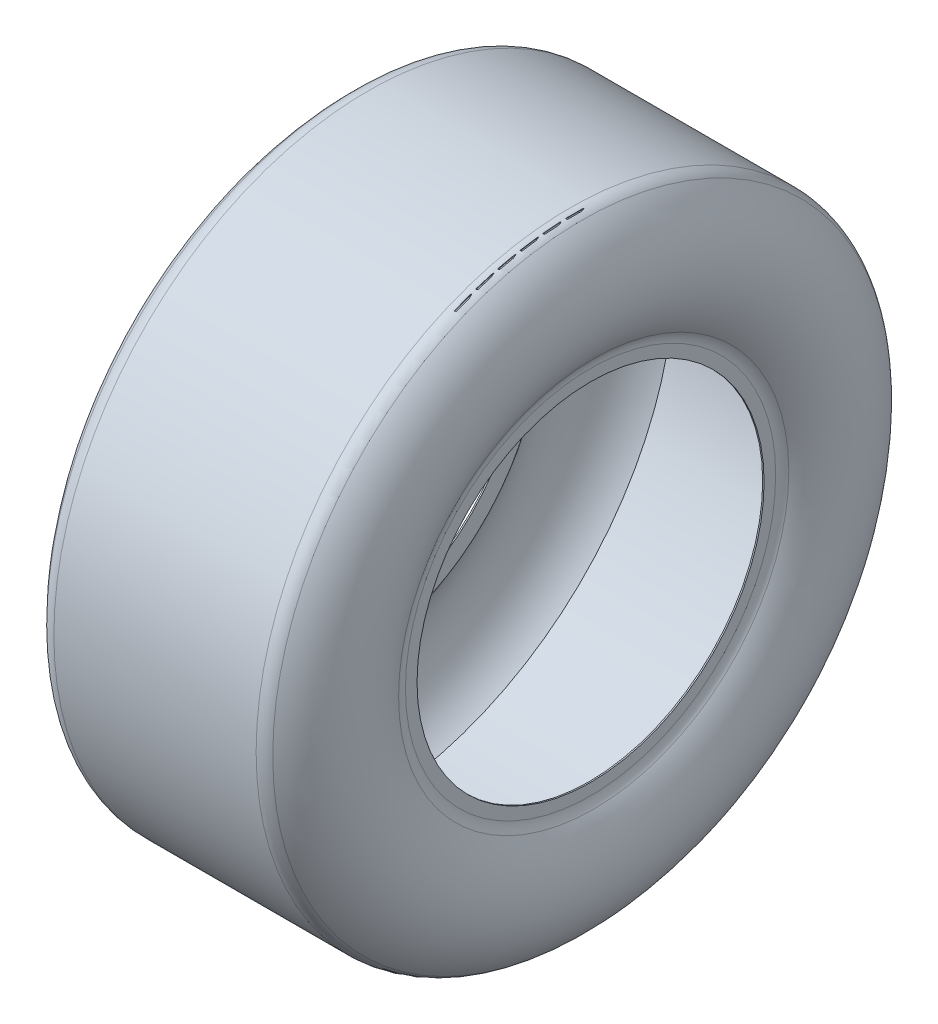
ISO-10303-21;
HEADER;
FILE_DESCRIPTION(('STEP AP214'),'2;1');
FILE_NAME('part.step','',(''),(''),'','','');
FILE_SCHEMA(('AUTOMOTIVE_DESIGN { 1 0 10303 214 1 1 1 1 }'));
ENDSEC;
DATA;
#1=APPLICATION_CONTEXT('core data for automotive mechanical design processes');
#2=APPLICATION_PROTOCOL_DEFINITION('international standard','automotive_design',2000,#1);
#3=PRODUCT_CONTEXT('',#1,'mechanical');
#4=PRODUCT('Part','Part','',(#3));
#5=PRODUCT_RELATED_PRODUCT_CATEGORY('part','',(#4));
#6=PRODUCT_DEFINITION_FORMATION('','',#4);
#7=PRODUCT_DEFINITION_CONTEXT('part definition',#1,'design');
#8=PRODUCT_DEFINITION('design','',#6,#7);
#9=PRODUCT_DEFINITION_SHAPE('','',#8);
#10=(LENGTH_UNIT() NAMED_UNIT(*) SI_UNIT(.MILLI.,.METRE.));
#11=(NAMED_UNIT(*) PLANE_ANGLE_UNIT() SI_UNIT($,.RADIAN.));
#12=(NAMED_UNIT(*) SI_UNIT($,.STERADIAN.) SOLID_ANGLE_UNIT());
#13=UNCERTAINTY_MEASURE_WITH_UNIT(LENGTH_MEASURE(1.E-05),#10,'distance_accuracy_value','');
#14=(GEOMETRIC_REPRESENTATION_CONTEXT(3) GLOBAL_UNCERTAINTY_ASSIGNED_CONTEXT((#13)) GLOBAL_UNIT_ASSIGNED_CONTEXT((#10,
#11,#12)) REPRESENTATION_CONTEXT('',''));
#15=CARTESIAN_POINT('',(0.,0.,0.));
#16=DIRECTION('',(0.,0.,1.));
#17=DIRECTION('',(1.,0.,0.));
#18=AXIS2_PLACEMENT_3D('',#15,#16,#17);
#19=CARTESIAN_POINT('',(0.,0.,0.));
#20=DIRECTION('',(1.,0.,0.));
#21=DIRECTION('',(0.,0.,-1.));
#22=AXIS2_PLACEMENT_3D('',#19,#20,#21);
#23=CYLINDRICAL_SURFACE('',#22,127.);
#24=CARTESIAN_POINT('',(-88.9,0.,0.));
#25=DIRECTION('',(1.,0.,0.));
#26=DIRECTION('',(0.,0.,-1.));
#27=AXIS2_PLACEMENT_3D('',#24,#25,#26);
#28=CIRCLE('',#27,127.);
#29=CARTESIAN_POINT('',(-88.9,0.,-127.));
#30=VERTEX_POINT('',#29);
#31=EDGE_CURVE('E68',#30,#30,#28,.T.);
#32=ORIENTED_EDGE('',*,*,#31,.F.);
#33=EDGE_LOOP('',(#32));
#34=FACE_BOUND('',#33,.T.);
#35=CARTESIAN_POINT('',(-87.884,0.,0.));
#36=DIRECTION('',(-1.,0.,0.));
#37=DIRECTION('',(0.,0.,1.));
#38=AXIS2_PLACEMENT_3D('',#35,#36,#37);
#39=CIRCLE('',#38,127.);
#40=CARTESIAN_POINT('',(-87.884,0.,127.));
#41=VERTEX_POINT('',#40);
#42=EDGE_CURVE('E80',#41,#41,#39,.F.);
#43=ORIENTED_EDGE('',*,*,#42,.T.);
#44=EDGE_LOOP('',(#43));
#45=FACE_BOUND('',#44,.T.);
#46=ADVANCED_FACE('F36',(#34,#45),#23,.F.);
#47=CARTESIAN_POINT('',(-38.6367960575817,0.,0.));
#48=DIRECTION('',(1.,0.,0.));
#49=DIRECTION('',(0.,0.,-1.));
#50=AXIS2_PLACEMENT_3D('',#47,#48,#49);
#51=TOROIDAL_SURFACE('',#50,179.693934767051,64.2332039424183);
#52=CARTESIAN_POINT('',(-91.2061433933359,0.,0.));
#53=DIRECTION('',(1.,0.,0.));
#54=DIRECTION('',(0.,0.,-1.));
#55=AXIS2_PLACEMENT_3D('',#52,#53,#54);
#56=CIRCLE('',#55,142.783662356771);
#57=CARTESIAN_POINT('',(-91.2061433933359,0.,-142.783662356771));
#58=VERTEX_POINT('',#57);
#59=EDGE_CURVE('E51',#58,#58,#56,.T.);
#60=ORIENTED_EDGE('',*,*,#59,.T.);
#61=EDGE_LOOP('',(#60));
#62=FACE_BOUND('',#61,.T.);
#63=CARTESIAN_POINT('',(-82.7266361202967,0.,0.));
#64=DIRECTION('',(1.,0.,0.));
#65=DIRECTION('',(0.,0.,-1.));
#66=AXIS2_PLACEMENT_3D('',#63,#64,#65);
#67=CIRCLE('',#66,226.40571585012);
#68=CARTESIAN_POINT('',(-82.7266361202967,0.,-226.40571585012));
#69=VERTEX_POINT('',#68);
#70=EDGE_CURVE('E56',#69,#69,#67,.F.);
#71=ORIENTED_EDGE('',*,*,#70,.T.);
#72=EDGE_LOOP('',(#71));
#73=FACE_BOUND('',#72,.T.);
#74=ADVANCED_FACE('F122',(#62,#73),#51,.T.);
#75=CARTESIAN_POINT('',(-88.9,0.,0.));
#76=DIRECTION('',(-1.,0.,0.));
#77=DIRECTION('',(0.,0.,1.));
#78=AXIS2_PLACEMENT_3D('',#75,#76,#77);
#79=PLANE('',#78);
#80=CARTESIAN_POINT('',(-88.9,0.,0.));
#81=DIRECTION('',(-1.,0.,0.));
#82=DIRECTION('',(0.,0.,1.));
#83=AXIS2_PLACEMENT_3D('',#80,#81,#82);
#84=CIRCLE('',#83,135.485871948702);
#85=CARTESIAN_POINT('',(-88.9,0.,135.485871948702));
#86=VERTEX_POINT('',#85);
#87=EDGE_CURVE('E47',#86,#86,#84,.T.);
#88=ORIENTED_EDGE('',*,*,#87,.T.);
#89=EDGE_LOOP('',(#88));
#90=FACE_BOUND('',#89,.T.);
#91=ORIENTED_EDGE('',*,*,#31,.T.);
#92=EDGE_LOOP('',(#91));
#93=FACE_BOUND('',#92,.T.);
#94=ADVANCED_FACE('F129',(#90,#93),#79,.T.);
#95=CARTESIAN_POINT('',(87.884,0.,0.));
#96=DIRECTION('',(1.,0.,0.));
#97=DIRECTION('',(0.,0.,-1.));
#98=AXIS2_PLACEMENT_3D('',#95,#96,#97);
#99=CIRCLE('',#98,127.);
#100=CARTESIAN_POINT('',(87.884,0.,-127.));
#101=VERTEX_POINT('',#100);
#102=EDGE_CURVE('E75',#101,#101,#99,.T.);
#103=ORIENTED_EDGE('',*,*,#102,.F.);
#104=EDGE_LOOP('',(#103));
#105=FACE_BOUND('',#104,.T.);
#106=CARTESIAN_POINT('',(88.9,0.,0.));
#107=DIRECTION('',(1.,0.,0.));
#108=DIRECTION('',(0.,0.,-1.));
#109=AXIS2_PLACEMENT_3D('',#106,#107,#108);
#110=CIRCLE('',#109,127.);
#111=CARTESIAN_POINT('',(88.9,0.,-127.));
#112=VERTEX_POINT('',#111);
#113=EDGE_CURVE('E71',#112,#112,#110,.T.);
#114=ORIENTED_EDGE('',*,*,#113,.T.);
#115=EDGE_LOOP('',(#114));
#116=FACE_BOUND('',#115,.T.);
#117=ADVANCED_FACE('F125',(#105,#116),#23,.F.);
#118=CARTESIAN_POINT('',(0.,0.,0.));
#119=DIRECTION('',(1.,0.,0.));
#120=DIRECTION('',(0.,0.,-1.));
#121=AXIS2_PLACEMENT_3D('',#118,#119,#120);
#122=CYLINDRICAL_SURFACE('',#121,229.87);
#123=CARTESIAN_POINT('',(74.0093227305049,0.,0.));
#124=DIRECTION('',(-1.,0.,0.));
#125=DIRECTION('',(0.,0.,1.));
#126=AXIS2_PLACEMENT_3D('',#123,#124,#125);
#127=CIRCLE('',#126,229.87);
#128=CARTESIAN_POINT('',(74.0093227305049,0.,229.87));
#129=VERTEX_POINT('',#128);
#130=EDGE_CURVE('E10',#129,#129,#127,.T.);
#131=ORIENTED_EDGE('',*,*,#130,.T.);
#132=EDGE_LOOP('',(#131));
#133=FACE_BOUND('',#132,.T.);
#134=CARTESIAN_POINT('',(-74.0093227305049,0.,0.));
#135=DIRECTION('',(-1.,0.,0.));
#136=DIRECTION('',(0.,0.,1.));
#137=AXIS2_PLACEMENT_3D('',#134,#135,#136);
#138=CIRCLE('',#137,229.87);
#139=CARTESIAN_POINT('',(-74.0093227305049,0.,229.87));
#140=VERTEX_POINT('',#139);
#141=EDGE_CURVE('E43',#140,#140,#138,.F.);
#142=ORIENTED_EDGE('',*,*,#141,.T.);
#143=EDGE_LOOP('',(#142));
#144=FACE_BOUND('',#143,.T.);
#145=ADVANCED_FACE('F137',(#133,#144),#122,.T.);
#146=CARTESIAN_POINT('',(38.6367960575817,0.,0.));
#147=DIRECTION('',(-1.,0.,0.));
#148=DIRECTION('',(0.,0.,-1.));
#149=AXIS2_PLACEMENT_3D('',#146,#147,#148);
#150=TOROIDAL_SURFACE('',#149,179.693934767051,64.2332039424183);
#151=CARTESIAN_POINT('',(91.2061433933359,0.,0.));
#152=DIRECTION('',(-1.,0.,0.));
#153=DIRECTION('',(0.,0.,1.));
#154=AXIS2_PLACEMENT_3D('',#151,#152,#153);
#155=CIRCLE('',#154,142.783662356771);
#156=CARTESIAN_POINT('',(91.2061433933359,0.,142.783662356771));
#157=VERTEX_POINT('',#156);
#158=EDGE_CURVE('E59',#157,#157,#155,.T.);
#159=ORIENTED_EDGE('',*,*,#158,.T.);
#160=EDGE_LOOP('',(#159));
#161=FACE_BOUND('',#160,.T.);
#162=CARTESIAN_POINT('',(82.7266361202967,0.,0.));
#163=DIRECTION('',(-1.,0.,0.));
#164=DIRECTION('',(0.,0.,1.));
#165=AXIS2_PLACEMENT_3D('',#162,#163,#164);
#166=CIRCLE('',#165,226.40571585012);
#167=CARTESIAN_POINT('',(82.7266361202967,0.,226.40571585012));
#168=VERTEX_POINT('',#167);
#169=EDGE_CURVE('E62',#168,#168,#166,.F.);
#170=ORIENTED_EDGE('',*,*,#169,.T.);
#171=EDGE_LOOP('',(#170));
#172=FACE_BOUND('',#171,.T.);
#173=ADVANCED_FACE('F143',(#161,#172),#150,.T.);
#174=CARTESIAN_POINT('',(88.9,0.,0.));
#175=DIRECTION('',(1.,0.,0.));
#176=DIRECTION('',(0.,0.,1.));
#177=AXIS2_PLACEMENT_3D('',#174,#175,#176);
#178=PLANE('',#177);
#179=CARTESIAN_POINT('',(88.9,0.,0.));
#180=DIRECTION('',(1.,0.,0.));
#181=DIRECTION('',(0.,0.,-1.));
#182=AXIS2_PLACEMENT_3D('',#179,#180,#181);
#183=CIRCLE('',#182,135.485871948702);
#184=CARTESIAN_POINT('',(88.9,0.,-135.485871948702));
#185=VERTEX_POINT('',#184);
#186=EDGE_CURVE('E65',#185,#185,#183,.T.);
#187=ORIENTED_EDGE('',*,*,#186,.T.);
#188=EDGE_LOOP('',(#187));
#189=FACE_BOUND('',#188,.T.);
#190=ORIENTED_EDGE('',*,*,#113,.F.);
#191=EDGE_LOOP('',(#190));
#192=FACE_BOUND('',#191,.T.);
#193=ADVANCED_FACE('F149',(#189,#192),#178,.T.);
#194=CARTESIAN_POINT('',(-38.6367960575817,0.,0.));
#195=DIRECTION('',(1.,0.,0.));
#196=DIRECTION('',(0.,0.,-1.));
#197=AXIS2_PLACEMENT_3D('',#194,#195,#196);
#198=TOROIDAL_SURFACE('',#197,179.693934767051,63.2172039424183);
#199=CARTESIAN_POINT('',(-78.3822720339686,0.,0.));
#200=DIRECTION('',(1.,0.,0.));
#201=DIRECTION('',(0.,0.,-1.));
#202=AXIS2_PLACEMENT_3D('',#199,#200,#201);
#203=CIRCLE('',#202,228.854);
#204=CARTESIAN_POINT('',(-78.3822720339686,0.,-228.854));
#205=VERTEX_POINT('',#204);
#206=EDGE_CURVE('E83',#205,#205,#203,.T.);
#207=ORIENTED_EDGE('',*,*,#206,.T.);
#208=EDGE_LOOP('',(#207));
#209=FACE_BOUND('',#208,.T.);
#210=CARTESIAN_POINT('',(-87.884,0.,0.));
#211=DIRECTION('',(1.,0.,0.));
#212=DIRECTION('',(0.,0.,-1.));
#213=AXIS2_PLACEMENT_3D('',#210,#211,#212);
#214=CIRCLE('',#213,140.056480533068);
#215=CARTESIAN_POINT('',(-87.884,0.,-140.056480533068));
#216=VERTEX_POINT('',#215);
#217=EDGE_CURVE('E74',#216,#216,#214,.T.);
#218=ORIENTED_EDGE('',*,*,#217,.F.);
#219=EDGE_LOOP('',(#218));
#220=FACE_BOUND('',#219,.T.);
#221=ADVANCED_FACE('F93',(#209,#220),#198,.F.);
#222=CARTESIAN_POINT('',(-87.884,0.,0.));
#223=DIRECTION('',(-1.,0.,0.));
#224=DIRECTION('',(0.,0.,1.));
#225=AXIS2_PLACEMENT_3D('',#222,#223,#224);
#226=PLANE('',#225);
#227=ORIENTED_EDGE('',*,*,#42,.F.);
#228=EDGE_LOOP('',(#227));
#229=FACE_BOUND('',#228,.T.);
#230=ORIENTED_EDGE('',*,*,#217,.T.);
#231=EDGE_LOOP('',(#230));
#232=FACE_BOUND('',#231,.T.);
#233=ADVANCED_FACE('F100',(#229,#232),#226,.F.);
#234=CARTESIAN_POINT('',(0.,0.,0.));
#235=DIRECTION('',(1.,0.,0.));
#236=DIRECTION('',(0.,0.,-1.));
#237=AXIS2_PLACEMENT_3D('',#234,#235,#236);
#238=CYLINDRICAL_SURFACE('',#237,228.854);
#239=ORIENTED_EDGE('',*,*,#206,.F.);
#240=EDGE_LOOP('',(#239));
#241=FACE_BOUND('',#240,.T.);
#242=CARTESIAN_POINT('',(78.3822720339686,0.,0.));
#243=DIRECTION('',(-1.,0.,0.));
#244=DIRECTION('',(0.,0.,1.));
#245=AXIS2_PLACEMENT_3D('',#242,#243,#244);
#246=CIRCLE('',#245,228.854);
#247=CARTESIAN_POINT('',(78.3822720339686,0.,228.854));
#248=VERTEX_POINT('',#247);
#249=EDGE_CURVE('E79',#248,#248,#246,.F.);
#250=ORIENTED_EDGE('',*,*,#249,.T.);
#251=EDGE_LOOP('',(#250));
#252=FACE_BOUND('',#251,.T.);
#253=ADVANCED_FACE('F96',(#241,#252),#238,.F.);
#254=CARTESIAN_POINT('',(38.6367960575817,0.,0.));
#255=DIRECTION('',(-1.,0.,0.));
#256=DIRECTION('',(0.,0.,-1.));
#257=AXIS2_PLACEMENT_3D('',#254,#255,#256);
#258=TOROIDAL_SURFACE('',#257,179.693934767051,63.2172039424183);
#259=ORIENTED_EDGE('',*,*,#249,.F.);
#260=EDGE_LOOP('',(#259));
#261=FACE_BOUND('',#260,.T.);
#262=CARTESIAN_POINT('',(87.884,0.,0.));
#263=DIRECTION('',(-1.,0.,0.));
#264=DIRECTION('',(0.,0.,1.));
#265=AXIS2_PLACEMENT_3D('',#262,#263,#264);
#266=CIRCLE('',#265,140.056480533068);
#267=CARTESIAN_POINT('',(87.884,0.,140.056480533068));
#268=VERTEX_POINT('',#267);
#269=EDGE_CURVE('E78',#268,#268,#266,.F.);
#270=ORIENTED_EDGE('',*,*,#269,.T.);
#271=EDGE_LOOP('',(#270));
#272=FACE_BOUND('',#271,.T.);
#273=ADVANCED_FACE('F99',(#261,#272),#258,.F.);
#274=CARTESIAN_POINT('',(87.884,0.,0.));
#275=DIRECTION('',(1.,0.,0.));
#276=DIRECTION('',(0.,0.,1.));
#277=AXIS2_PLACEMENT_3D('',#274,#275,#276);
#278=PLANE('',#277);
#279=ORIENTED_EDGE('',*,*,#102,.T.);
#280=EDGE_LOOP('',(#279));
#281=FACE_BOUND('',#280,.T.);
#282=ORIENTED_EDGE('',*,*,#269,.F.);
#283=EDGE_LOOP('',(#282));
#284=FACE_BOUND('',#283,.T.);
#285=ADVANCED_FACE('F106',(#281,#284),#278,.F.);
#286=CARTESIAN_POINT('',(101.6,0.,0.));
#287=DIRECTION('',(-1.,0.,0.));
#288=DIRECTION('',(0.,0.,1.));
#289=AXIS2_PLACEMENT_3D('',#286,#287,#288);
#290=TOROIDAL_SURFACE('',#289,135.485871948702,12.7);
#291=ORIENTED_EDGE('',*,*,#158,.F.);
#292=EDGE_LOOP('',(#291));
#293=FACE_BOUND('',#292,.T.);
#294=ORIENTED_EDGE('',*,*,#186,.F.);
#295=EDGE_LOOP('',(#294));
#296=FACE_BOUND('',#295,.T.);
#297=ADVANCED_FACE('F111',(#293,#296),#290,.F.);
#298=CARTESIAN_POINT('',(-101.6,0.,0.));
#299=DIRECTION('',(1.,0.,0.));
#300=DIRECTION('',(0.,0.,-1.));
#301=AXIS2_PLACEMENT_3D('',#298,#299,#300);
#302=TOROIDAL_SURFACE('',#301,135.485871948702,12.7);
#303=ORIENTED_EDGE('',*,*,#87,.F.);
#304=EDGE_LOOP('',(#303));
#305=FACE_BOUND('',#304,.T.);
#306=ORIENTED_EDGE('',*,*,#59,.F.);
#307=EDGE_LOOP('',(#306));
#308=FACE_BOUND('',#307,.T.);
#309=ADVANCED_FACE('F117',(#305,#308),#302,.F.);
#310=CARTESIAN_POINT('',(74.0093227305049,0.,0.));
#311=DIRECTION('',(-1.,0.,0.));
#312=DIRECTION('',(0.,0.,1.));
#313=AXIS2_PLACEMENT_3D('',#310,#311,#312);
#314=TOROIDAL_SURFACE('',#313,217.17,12.7);
#315=ORIENTED_EDGE('',*,*,#130,.F.);
#316=EDGE_LOOP('',(#315));
#317=FACE_BOUND('',#316,.T.);
#318=ORIENTED_EDGE('',*,*,#169,.F.);
#319=EDGE_LOOP('',(#318));
#320=FACE_BOUND('',#319,.T.);
#321=ADVANCED_FACE('F167',(#317,#320),#314,.T.);
#322=CARTESIAN_POINT('',(-74.0093227305049,0.,0.));
#323=DIRECTION('',(-1.,0.,0.));
#324=DIRECTION('',(0.,0.,1.));
#325=AXIS2_PLACEMENT_3D('',#322,#323,#324);
#326=TOROIDAL_SURFACE('',#325,217.17,12.7);
#327=ORIENTED_EDGE('',*,*,#70,.F.);
#328=EDGE_LOOP('',(#327));
#329=FACE_BOUND('',#328,.T.);
#330=ORIENTED_EDGE('',*,*,#141,.F.);
#331=EDGE_LOOP('',(#330));
#332=FACE_BOUND('',#331,.T.);
#333=ADVANCED_FACE('F38',(#329,#332),#326,.T.);
#334=CLOSED_SHELL('',(#46,#74,#94,#117,#145,#173,#193,#221,#233,#253,#273,#285,#297,#309,#321,#333));
#335=MANIFOLD_SOLID_BREP('B2',#334);
#336=ADVANCED_BREP_SHAPE_REPRESENTATION('',(#18,#335),#14);
#337=SHAPE_DEFINITION_REPRESENTATION(#9,#336);
ENDSEC;
END-ISO-10303-21;
